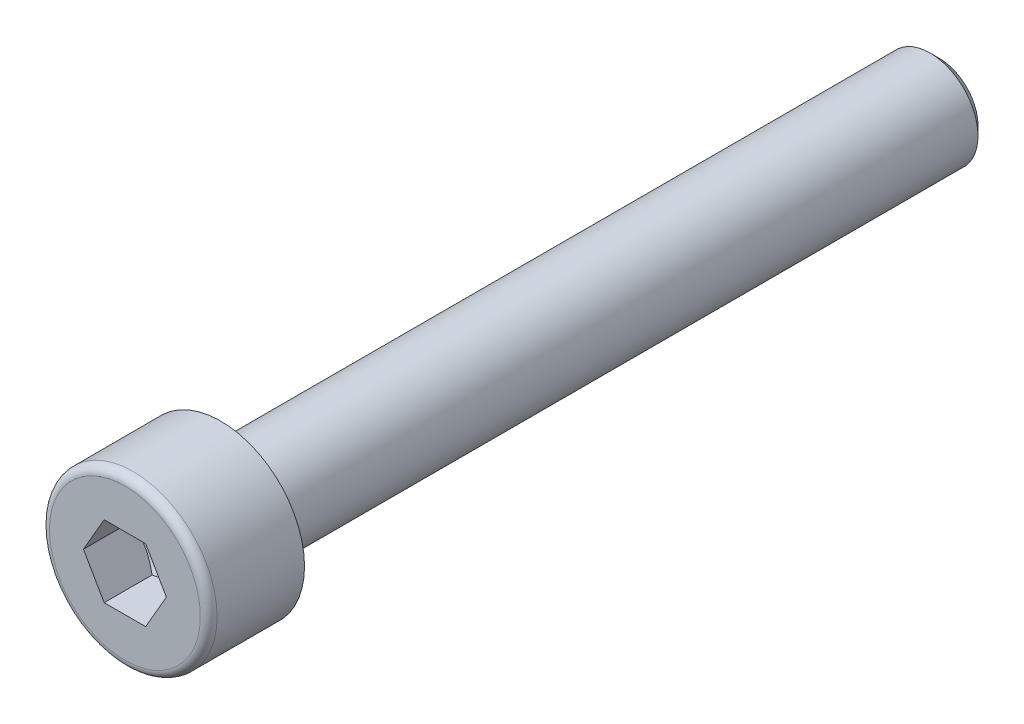
ISO-10303-21;
HEADER;
FILE_DESCRIPTION(('STEP AP214'),'2;1');
FILE_NAME('part.step','',(''),(''),'','','');
FILE_SCHEMA(('AUTOMOTIVE_DESIGN { 1 0 10303 214 1 1 1 1 }'));
ENDSEC;
DATA;
#1=APPLICATION_CONTEXT('core data for automotive mechanical design processes');
#2=APPLICATION_PROTOCOL_DEFINITION('international standard','automotive_design',2000,#1);
#3=PRODUCT_CONTEXT('',#1,'mechanical');
#4=PRODUCT('Part','Part','',(#3));
#5=PRODUCT_RELATED_PRODUCT_CATEGORY('part','',(#4));
#6=PRODUCT_DEFINITION_FORMATION('','',#4);
#7=PRODUCT_DEFINITION_CONTEXT('part definition',#1,'design');
#8=PRODUCT_DEFINITION('design','',#6,#7);
#9=PRODUCT_DEFINITION_SHAPE('','',#8);
#10=(LENGTH_UNIT() NAMED_UNIT(*) SI_UNIT(.MILLI.,.METRE.));
#11=(NAMED_UNIT(*) PLANE_ANGLE_UNIT() SI_UNIT($,.RADIAN.));
#12=(NAMED_UNIT(*) SI_UNIT($,.STERADIAN.) SOLID_ANGLE_UNIT());
#13=UNCERTAINTY_MEASURE_WITH_UNIT(LENGTH_MEASURE(1.E-05),#10,'distance_accuracy_value','');
#14=(GEOMETRIC_REPRESENTATION_CONTEXT(3) GLOBAL_UNCERTAINTY_ASSIGNED_CONTEXT((#13)) GLOBAL_UNIT_ASSIGNED_CONTEXT((#10,
#11,#12)) REPRESENTATION_CONTEXT('',''));
#15=CARTESIAN_POINT('',(0.,0.,0.));
#16=DIRECTION('',(0.,0.,1.));
#17=DIRECTION('',(1.,0.,0.));
#18=AXIS2_PLACEMENT_3D('',#15,#16,#17);
#19=CARTESIAN_POINT('',(0.,3.15,4.));
#20=DIRECTION('',(0.,0.,-1.));
#21=DIRECTION('',(-1.,0.,0.));
#22=AXIS2_PLACEMENT_3D('',#19,#20,#21);
#23=PLANE('',#22);
#24=CARTESIAN_POINT('',(0.,0.,4.));
#25=DIRECTION('',(0.,0.,-1.));
#26=DIRECTION('',(-1.,0.,0.));
#27=AXIS2_PLACEMENT_3D('',#24,#25,#26);
#28=CIRCLE('',#27,3.15);
#29=CARTESIAN_POINT('',(-3.15,0.,4.));
#30=VERTEX_POINT('',#29);
#31=EDGE_CURVE('E54',#30,#30,#28,.F.);
#32=ORIENTED_EDGE('',*,*,#31,.T.);
#33=EDGE_LOOP('',(#32));
#34=FACE_BOUND('',#33,.T.);
#35=DIRECTION('',(0.5,-0.866025403784438,0.));
#36=VECTOR('',#35,1.);
#37=CARTESIAN_POINT('',(0.866025,1.49999930062484,4.));
#38=LINE('',#37,#36);
#39=CARTESIAN_POINT('',(0.866025,1.49999930062484,4.));
#40=VERTEX_POINT('',#39);
#41=CARTESIAN_POINT('',(1.73205,0.,4.));
#42=VERTEX_POINT('',#41);
#43=EDGE_CURVE('E61',#40,#42,#38,.T.);
#44=ORIENTED_EDGE('',*,*,#43,.T.);
#45=DIRECTION('',(-0.5,-0.866025403784439,0.));
#46=VECTOR('',#45,1.);
#47=CARTESIAN_POINT('',(1.73205,0.,4.));
#48=LINE('',#47,#46);
#49=CARTESIAN_POINT('',(0.866025,-1.49999930062484,4.));
#50=VERTEX_POINT('',#49);
#51=EDGE_CURVE('E191',#42,#50,#48,.T.);
#52=ORIENTED_EDGE('',*,*,#51,.T.);
#53=DIRECTION('',(-1.,0.,0.));
#54=VECTOR('',#53,1.);
#55=CARTESIAN_POINT('',(0.866025,-1.49999930062484,4.));
#56=LINE('',#55,#54);
#57=CARTESIAN_POINT('',(-0.866025,-1.49999930062484,4.));
#58=VERTEX_POINT('',#57);
#59=EDGE_CURVE('E463',#50,#58,#56,.T.);
#60=ORIENTED_EDGE('',*,*,#59,.T.);
#61=DIRECTION('',(-0.5,0.866025403784439,0.));
#62=VECTOR('',#61,1.);
#63=CARTESIAN_POINT('',(-0.866025,-1.49999930062484,4.));
#64=LINE('',#63,#62);
#65=CARTESIAN_POINT('',(-1.73205,0.,4.));
#66=VERTEX_POINT('',#65);
#67=EDGE_CURVE('E469',#58,#66,#64,.T.);
#68=ORIENTED_EDGE('',*,*,#67,.T.);
#69=DIRECTION('',(0.5,0.866025403784439,0.));
#70=VECTOR('',#69,1.);
#71=CARTESIAN_POINT('',(-1.73205,0.,4.));
#72=LINE('',#71,#70);
#73=CARTESIAN_POINT('',(-0.866025,1.49999930062484,4.));
#74=VERTEX_POINT('',#73);
#75=EDGE_CURVE('E132',#66,#74,#72,.T.);
#76=ORIENTED_EDGE('',*,*,#75,.T.);
#77=DIRECTION('',(1.,0.,0.));
#78=VECTOR('',#77,1.);
#79=CARTESIAN_POINT('',(-0.866025,1.49999930062484,4.));
#80=LINE('',#79,#78);
#81=EDGE_CURVE('E124',#74,#40,#80,.T.);
#82=ORIENTED_EDGE('',*,*,#81,.T.);
#83=EDGE_LOOP('',(#44,#52,#60,#68,#76,#82));
#84=FACE_BOUND('',#83,.T.);
#85=ADVANCED_FACE('F46',(#34,#84),#23,.F.);
#86=CARTESIAN_POINT('',(0.,0.,0.));
#87=DIRECTION('',(0.,0.,1.));
#88=DIRECTION('',(1.,0.,0.));
#89=AXIS2_PLACEMENT_3D('',#86,#87,#88);
#90=PLANE('',#89);
#91=CARTESIAN_POINT('',(0.,0.,0.));
#92=DIRECTION('',(0.,0.,1.));
#93=DIRECTION('',(1.,0.,0.));
#94=AXIS2_PLACEMENT_3D('',#91,#92,#93);
#95=CIRCLE('',#94,3.5);
#96=CARTESIAN_POINT('',(3.5,0.,0.));
#97=VERTEX_POINT('',#96);
#98=EDGE_CURVE('E148',#97,#97,#95,.T.);
#99=ORIENTED_EDGE('',*,*,#98,.F.);
#100=EDGE_LOOP('',(#99));
#101=FACE_BOUND('',#100,.T.);
#102=CARTESIAN_POINT('',(0.,0.,0.));
#103=DIRECTION('',(0.,0.,1.));
#104=DIRECTION('',(1.,0.,0.));
#105=AXIS2_PLACEMENT_3D('',#102,#103,#104);
#106=CIRCLE('',#105,2.);
#107=CARTESIAN_POINT('',(2.,0.,0.));
#108=VERTEX_POINT('',#107);
#109=EDGE_CURVE('E153',#108,#108,#106,.F.);
#110=ORIENTED_EDGE('',*,*,#109,.F.);
#111=EDGE_LOOP('',(#110));
#112=FACE_BOUND('',#111,.T.);
#113=ADVANCED_FACE('F242',(#101,#112),#90,.F.);
#114=CARTESIAN_POINT('',(0.,0.,4.));
#115=DIRECTION('',(0.,0.,1.));
#116=DIRECTION('',(1.,0.,0.));
#117=AXIS2_PLACEMENT_3D('',#114,#115,#116);
#118=CYLINDRICAL_SURFACE('',#117,3.5);
#119=CARTESIAN_POINT('',(0.,0.,3.65));
#120=DIRECTION('',(0.,0.,-1.));
#121=DIRECTION('',(-1.,0.,0.));
#122=AXIS2_PLACEMENT_3D('',#119,#120,#121);
#123=CIRCLE('',#122,3.5);
#124=CARTESIAN_POINT('',(-3.5,0.,3.65));
#125=VERTEX_POINT('',#124);
#126=EDGE_CURVE('E12',#125,#125,#123,.T.);
#127=ORIENTED_EDGE('',*,*,#126,.T.);
#128=EDGE_LOOP('',(#127));
#129=FACE_BOUND('',#128,.T.);
#130=ORIENTED_EDGE('',*,*,#98,.T.);
#131=EDGE_LOOP('',(#130));
#132=FACE_BOUND('',#131,.T.);
#133=ADVANCED_FACE('F248',(#129,#132),#118,.T.);
#134=CARTESIAN_POINT('',(0.,0.,0.));
#135=DIRECTION('',(0.,0.,1.));
#136=DIRECTION('',(1.,0.,0.));
#137=AXIS2_PLACEMENT_3D('',#134,#135,#136);
#138=CYLINDRICAL_SURFACE('',#137,2.);
#139=ORIENTED_EDGE('',*,*,#109,.T.);
#140=EDGE_LOOP('',(#139));
#141=FACE_BOUND('',#140,.T.);
#142=CARTESIAN_POINT('',(0.,0.,-29.621125));
#143=DIRECTION('',(0.,0.,-1.));
#144=DIRECTION('',(-1.,0.,0.));
#145=AXIS2_PLACEMENT_3D('',#142,#143,#144);
#146=CIRCLE('',#145,2.);
#147=CARTESIAN_POINT('',(-2.,0.,-29.621125));
#148=VERTEX_POINT('',#147);
#149=EDGE_CURVE('E267',#148,#148,#146,.F.);
#150=ORIENTED_EDGE('',*,*,#149,.T.);
#151=EDGE_LOOP('',(#150));
#152=FACE_BOUND('',#151,.T.);
#153=ADVANCED_FACE('F240',(#141,#152),#138,.T.);
#154=CARTESIAN_POINT('',(0.866025,1.49999930062484,1.00000046625011));
#155=DIRECTION('',(-0.866025403784438,-0.5,0.));
#156=DIRECTION('',(-0.5,0.866025403784438,0.));
#157=AXIS2_PLACEMENT_3D('',#154,#155,#156);
#158=PLANE('',#157);
#159=DIRECTION('',(0.,0.,1.));
#160=VECTOR('',#159,1.);
#161=CARTESIAN_POINT('',(1.73205,0.,1.00000046625011));
#162=LINE('',#161,#160);
#163=CARTESIAN_POINT('',(1.73205,0.,2.));
#164=VERTEX_POINT('',#163);
#165=EDGE_CURVE('E145',#164,#42,#162,.T.);
#166=ORIENTED_EDGE('',*,*,#165,.T.);
#167=ORIENTED_EDGE('',*,*,#43,.F.);
#168=DIRECTION('',(0.,0.,1.));
#169=VECTOR('',#168,1.);
#170=CARTESIAN_POINT('',(0.866025,1.49999930062484,1.00000046625011));
#171=LINE('',#170,#169);
#172=CARTESIAN_POINT('',(0.866025,1.49999930062484,2.));
#173=VERTEX_POINT('',#172);
#174=EDGE_CURVE('E117',#173,#40,#171,.T.);
#175=ORIENTED_EDGE('',*,*,#174,.F.);
#176=CARTESIAN_POINT('',(1.73205115470054,-2.E-06,2.00000066666734));
#177=CARTESIAN_POINT('',(1.69399458130122,0.0659139186895892,1.97802228100261));
#178=CARTESIAN_POINT('',(1.65560950414464,0.132398822577242,1.95803408114054));
#179=CARTESIAN_POINT('',(1.57817473630843,0.266519774741864,1.92314525941874));
#180=CARTESIAN_POINT('',(1.53912367019894,0.334158205333232,1.90825697858766));
#181=CARTESIAN_POINT('',(1.46150547885139,0.468596856338784,1.88508226983918));
#182=CARTESIAN_POINT('',(1.42295029290091,0.535376397300293,1.87664158385231));
#183=CARTESIAN_POINT('',(1.34565859846878,0.669249539059823,1.86656700525616));
#184=CARTESIAN_POINT('',(1.30692237073331,0.736342653591208,1.86492476807133));
#185=CARTESIAN_POINT('',(1.23454773253413,0.861699204131607,1.86834969801067));
#186=CARTESIAN_POINT('',(1.20089846229767,0.919981449818777,1.87257593125167));
#187=CARTESIAN_POINT('',(1.1338191361032,1.03616625092508,1.88596796669928));
#188=CARTESIAN_POINT('',(1.10038931198579,1.09406840478452,1.89513833923059));
#189=CARTESIAN_POINT('',(1.03317179328088,1.21049256234014,1.91806252128818));
#190=CARTESIAN_POINT('',(0.999392601793287,1.26899983823525,1.93191346069662));
#191=CARTESIAN_POINT('',(0.932337893068965,1.38514200063251,1.96334924731355));
#192=CARTESIAN_POINT('',(0.89906151743008,1.4427783739308,1.980926712986));
#193=CARTESIAN_POINT('',(0.866023845299461,1.50000130062484,2.00000066666734));
#194=B_SPLINE_CURVE_WITH_KNOTS('',3,(#176,#177,#178,#179,#180,#181,#182,#183,#184,#185,#186,
#187,#188,#189,#190,#191,#192,#193),.UNSPECIFIED.,.F.,.F.,(4,2,2,2,2,2,2,2,4),(0.,
0.237762055931485,0.476095461361748,0.708530837844131,0.94068083294838,1.14278193102308,
1.34507017093339,1.55184422617205,1.75821246569164),.UNSPECIFIED.);
#195=EDGE_CURVE('E109',#164,#173,#194,.T.);
#196=ORIENTED_EDGE('',*,*,#195,.F.);
#197=EDGE_LOOP('',(#166,#167,#175,#196));
#198=FACE_BOUND('',#197,.T.);
#199=ADVANCED_FACE('F118',(#198),#158,.T.);
#200=CARTESIAN_POINT('',(1.73205,0.,1.00000046625011));
#201=DIRECTION('',(-0.866025403784439,0.5,0.));
#202=DIRECTION('',(0.5,0.866025403784439,0.));
#203=AXIS2_PLACEMENT_3D('',#200,#201,#202);
#204=PLANE('',#203);
#205=DIRECTION('',(0.,0.,1.));
#206=VECTOR('',#205,1.);
#207=CARTESIAN_POINT('',(0.866025,-1.49999930062484,1.00000046625011));
#208=LINE('',#207,#206);
#209=CARTESIAN_POINT('',(0.866025,-1.49999930062484,2.));
#210=VERTEX_POINT('',#209);
#211=EDGE_CURVE('E142',#210,#50,#208,.T.);
#212=ORIENTED_EDGE('',*,*,#211,.T.);
#213=ORIENTED_EDGE('',*,*,#51,.F.);
#214=ORIENTED_EDGE('',*,*,#165,.F.);
#215=CARTESIAN_POINT('',(0.866023845299462,-1.50000130062484,2.00000066666734));
#216=CARTESIAN_POINT('',(0.904080418698778,-1.43408538193525,1.9780222810026));
#217=CARTESIAN_POINT('',(0.942465495855361,-1.36760047804759,1.95803408114054));
#218=CARTESIAN_POINT('',(1.01990026369157,-1.23347952588297,1.92314525941874));
#219=CARTESIAN_POINT('',(1.05895132980106,-1.1658410952916,1.90825697858766));
#220=CARTESIAN_POINT('',(1.13656952114861,-1.03140244428605,1.88508226983918));
#221=CARTESIAN_POINT('',(1.1751247070991,-0.964622903324544,1.87664158385231));
#222=CARTESIAN_POINT('',(1.25241640153122,-0.830749761565014,1.86656700525616));
#223=CARTESIAN_POINT('',(1.29115262926669,-0.763656647033629,1.86492476807133));
#224=CARTESIAN_POINT('',(1.36352726746587,-0.638300096493229,1.86834969801067));
#225=CARTESIAN_POINT('',(1.39717653770233,-0.58001785080606,1.87257593125166));
#226=CARTESIAN_POINT('',(1.4642558638968,-0.463833049699756,1.88596796669928));
#227=CARTESIAN_POINT('',(1.49768568801421,-0.405930895840313,1.89513833923059));
#228=CARTESIAN_POINT('',(1.56490320671912,-0.2895067382847,1.91806252128818));
#229=CARTESIAN_POINT('',(1.59868239820671,-0.230999462389588,1.93191346069662));
#230=CARTESIAN_POINT('',(1.66573710693103,-0.11485729999233,1.96334924731355));
#231=CARTESIAN_POINT('',(1.69901348256992,-0.0572209266940348,1.980926712986));
#232=CARTESIAN_POINT('',(1.73205115470054,1.99999999979098E-06,2.00000066666734));
#233=B_SPLINE_CURVE_WITH_KNOTS('',3,(#215,#216,#217,#218,#219,#220,#221,#222,#223,#224,#225,
#226,#227,#228,#229,#230,#231,#232),.UNSPECIFIED.,.F.,.F.,(4,2,2,2,2,2,2,2,4),(0.,
0.237762055931484,0.476095461361747,0.708530837844129,0.940680832948377,1.14278193102307,
1.34507017093338,1.55184422617205,1.75821246569164),.UNSPECIFIED.);
#234=EDGE_CURVE('E113',#210,#164,#233,.T.);
#235=ORIENTED_EDGE('',*,*,#234,.F.);
#236=EDGE_LOOP('',(#212,#213,#214,#235));
#237=FACE_BOUND('',#236,.T.);
#238=ADVANCED_FACE('F231',(#237),#204,.T.);
#239=CARTESIAN_POINT('',(0.866025,-1.49999930062484,1.00000046625011));
#240=DIRECTION('',(0.,1.,0.));
#241=DIRECTION('',(1.,0.,0.));
#242=AXIS2_PLACEMENT_3D('',#239,#240,#241);
#243=PLANE('',#242);
#244=DIRECTION('',(0.,0.,1.));
#245=VECTOR('',#244,1.);
#246=CARTESIAN_POINT('',(-0.866025,-1.49999930062484,1.00000046625011));
#247=LINE('',#246,#245);
#248=CARTESIAN_POINT('',(-0.866025,-1.49999930062484,2.));
#249=VERTEX_POINT('',#248);
#250=EDGE_CURVE('E139',#249,#58,#247,.T.);
#251=ORIENTED_EDGE('',*,*,#250,.T.);
#252=ORIENTED_EDGE('',*,*,#59,.F.);
#253=ORIENTED_EDGE('',*,*,#211,.F.);
#254=CARTESIAN_POINT('',(-2.24271663728987,-1.49999930062484,2.55775267344395));
#255=CARTESIAN_POINT('',(-2.17794141332338,-1.49999930062484,2.52667596135368));
#256=CARTESIAN_POINT('',(-2.11300852130655,-1.49999930062484,2.49592211621229));
#257=CARTESIAN_POINT('',(-1.98274303131292,-1.49999930062484,2.43524311162405));
#258=CARTESIAN_POINT('',(-1.91741036395219,-1.49999930062484,2.40531810131238));
#259=CARTESIAN_POINT('',(-1.78588635397686,-1.49999930062484,2.34631254095844));
#260=CARTESIAN_POINT('',(-1.71969220663993,-1.49999930062484,2.31723821458641));
#261=CARTESIAN_POINT('',(-1.58674953026847,-1.49999930062484,2.26039396688304));
#262=CARTESIAN_POINT('',(-1.52000103027226,-1.49999930062484,2.23262397772829));
#263=CARTESIAN_POINT('',(-1.38408036083489,-1.49999930062484,2.17802545642731));
#264=CARTESIAN_POINT('',(-1.31489044686774,-1.49999930062484,2.1512405113674));
#265=CARTESIAN_POINT('',(-1.17568875836751,-1.49999930062484,2.09990652822181));
#266=CARTESIAN_POINT('',(-1.10567688208708,-1.49999930062484,2.07535777031023));
#267=CARTESIAN_POINT('',(-0.894522216300188,-1.49999930062484,2.0061010834001));
#268=CARTESIAN_POINT('',(-0.751873977094198,-1.49999930062484,1.9656202744164));
#269=CARTESIAN_POINT('',(-0.535047450977606,-1.49999930062484,1.9186645261203));
#270=CARTESIAN_POINT('',(-0.462365424606466,-1.49999930062484,1.90531291688069));
#271=CARTESIAN_POINT('',(-0.316183762847225,-1.49999930062484,1.8841134767258));
#272=CARTESIAN_POINT('',(-0.242684183051902,-1.49999930062484,1.87626527388084));
#273=CARTESIAN_POINT('',(-0.0961588910059515,-1.49999930062484,1.86679859934064));
#274=CARTESIAN_POINT('',(-0.0231380525234333,-1.49999930062484,1.86510661239957));
#275=CARTESIAN_POINT('',(0.122783022434076,-1.49999930062484,1.86789948707645));
#276=CARTESIAN_POINT('',(0.195683251161583,-1.49999930062484,1.8723847311637));
#277=CARTESIAN_POINT('',(0.375553746438775,-1.49999930062484,1.89067768491976));
#278=CARTESIAN_POINT('',(0.4821754471692,-1.49999930062484,1.90791354190592));
#279=CARTESIAN_POINT('',(0.693345462539466,-1.49999930062484,1.95235984396466));
#280=CARTESIAN_POINT('',(0.79789111749796,-1.49999930062484,1.97958231080908));
#281=CARTESIAN_POINT('',(0.954250638010105,-1.49999930062484,2.02608493590371));
#282=CARTESIAN_POINT('',(1.00687274480645,-1.49999930062484,2.04274751774646));
#283=CARTESIAN_POINT('',(1.11156919647057,-1.49999930062484,2.07761406562061));
#284=CARTESIAN_POINT('',(1.16364386068557,-1.49999930062484,2.09581706970924));
#285=CARTESIAN_POINT('',(1.26731501755411,-1.49999930062484,2.13350010092581));
#286=CARTESIAN_POINT('',(1.31891159517315,-1.49999930062484,2.15297989597396));
#287=CARTESIAN_POINT('',(1.42169818698628,-1.49999930062484,2.19300580386973));
#288=CARTESIAN_POINT('',(1.47288813079445,-1.49999930062484,2.21355209687612));
#289=CARTESIAN_POINT('',(1.6035520536722,-1.49999930062484,2.26731329701247));
#290=CARTESIAN_POINT('',(1.68276476914258,-1.49999930062484,2.30116251352867));
#291=CARTESIAN_POINT('',(1.84047488481565,-1.49999930062484,2.37049266735));
#292=CARTESIAN_POINT('',(1.9189722309026,-1.49999930062484,2.40597372689195));
#293=CARTESIAN_POINT('',(2.15362957255391,-1.49999930062484,2.51428942992019));
#294=CARTESIAN_POINT('',(2.3089286607519,-1.49999930062484,2.58898549353906));
#295=CARTESIAN_POINT('',(2.61820006623532,-1.49999930062484,2.74151036059574));
#296=CARTESIAN_POINT('',(2.77217051778771,-1.49999930062484,2.81934290231597));
#297=CARTESIAN_POINT('',(3.07905650209162,-1.49999930062484,2.97700931547993));
#298=CARTESIAN_POINT('',(3.23197216581148,-1.49999930062484,3.05684293253984));
#299=CARTESIAN_POINT('',(3.52267476728495,-1.49999930062484,3.21028853935711));
#300=CARTESIAN_POINT('',(3.66052737206612,-1.49999930062484,3.28377655462836));
#301=CARTESIAN_POINT('',(3.93578914881928,-1.49999930062484,3.43158990958268));
#302=CARTESIAN_POINT('',(4.07319830413762,-1.49999930062484,3.50591528025237));
#303=CARTESIAN_POINT('',(4.34732590427536,-1.49999930062483,3.65500351537988));
#304=CARTESIAN_POINT('',(4.48404521696312,-1.49999930062483,3.72976478622522));
#305=CARTESIAN_POINT('',(4.75720742747683,-1.49999930062483,3.87977391809883));
#306=CARTESIAN_POINT('',(4.89365033939364,-1.49999930062484,3.9550217534582));
#307=CARTESIAN_POINT('',(5.02999394665514,-1.49999930062484,4.03044801324502));
#308=B_SPLINE_CURVE_WITH_KNOTS('',3,(#254,#255,#256,#257,#258,#259,#260,#261,#262,#263,#264,
#265,#266,#267,#268,#269,#270,#271,#272,#273,#274,#275,#276,#277,#278,#279,#280,#281,#282,#283,
#284,#285,#286,#287,#288,#289,#290,#291,#292,#293,#294,#295,#296,#297,#298,#299,#300,#301,#302,
#303,#304,#305,#306,#307),.UNSPECIFIED.,.F.,.F.,(4,2,2,2,2,2,2,2,2,2,2,2,2,2,2,2,2,2,2,2,2,2,2,
2,2,2,4),(0.,0.215535408976475,0.431109351318747,0.647990972858705,0.864861304394723,
1.08740082372431,1.30996818700982,1.75384735851117,1.97537373294937,2.19688513480997,
2.41574248382684,2.63461338422016,2.95796620171825,3.28170955197757,3.44728283297626,
3.61275347131505,3.77819411534645,3.94366279806486,4.20206179692704,4.46048018336434,
4.97740230798824,5.49495989978084,6.01245202818902,6.48110050133562,6.94976637432356,
7.41724019162004,7.88468954517039),.UNSPECIFIED.);
#309=EDGE_CURVE('E221',#249,#210,#308,.T.);
#310=ORIENTED_EDGE('',*,*,#309,.F.);
#311=EDGE_LOOP('',(#251,#252,#253,#310));
#312=FACE_BOUND('',#311,.T.);
#313=ADVANCED_FACE('F227',(#312),#243,.T.);
#314=CARTESIAN_POINT('',(-0.866025,-1.49999930062484,1.00000046625011));
#315=DIRECTION('',(0.866025403784439,0.5,0.));
#316=DIRECTION('',(0.5,-0.866025403784439,0.));
#317=AXIS2_PLACEMENT_3D('',#314,#315,#316);
#318=PLANE('',#317);
#319=DIRECTION('',(0.,0.,1.));
#320=VECTOR('',#319,1.);
#321=CARTESIAN_POINT('',(-1.73205,0.,1.00000046625011));
#322=LINE('',#321,#320);
#323=CARTESIAN_POINT('',(-1.73205,0.,2.));
#324=VERTEX_POINT('',#323);
#325=EDGE_CURVE('E130',#324,#66,#322,.T.);
#326=ORIENTED_EDGE('',*,*,#325,.T.);
#327=ORIENTED_EDGE('',*,*,#67,.F.);
#328=ORIENTED_EDGE('',*,*,#250,.F.);
#329=CARTESIAN_POINT('',(-1.73205115470054,1.99999999935948E-06,2.00000066666734));
#330=CARTESIAN_POINT('',(-1.69399458130122,-0.0659139186895897,1.97802228100261));
#331=CARTESIAN_POINT('',(-1.65560950414464,-0.132398822577242,1.95803408114054));
#332=CARTESIAN_POINT('',(-1.57817473630843,-0.266519774741865,1.92314525941874));
#333=CARTESIAN_POINT('',(-1.53912367019894,-0.334158205333233,1.90825697858766));
#334=CARTESIAN_POINT('',(-1.46150547885139,-0.468596856338785,1.88508226983918));
#335=CARTESIAN_POINT('',(-1.4229502929009,-0.535376397300293,1.87664158385231));
#336=CARTESIAN_POINT('',(-1.34565859846878,-0.669249539059823,1.86656700525616));
#337=CARTESIAN_POINT('',(-1.30692237073331,-0.736342653591209,1.86492476807133));
#338=CARTESIAN_POINT('',(-1.23454773253413,-0.861699204131608,1.86834969801067));
#339=CARTESIAN_POINT('',(-1.20089846229767,-0.919981449818777,1.87257593125166));
#340=CARTESIAN_POINT('',(-1.1338191361032,-1.03616625092508,1.88596796669928));
#341=CARTESIAN_POINT('',(-1.10038931198579,-1.09406840478452,1.89513833923059));
#342=CARTESIAN_POINT('',(-1.03317179328088,-1.21049256234014,1.91806252128818));
#343=CARTESIAN_POINT('',(-0.999392601793289,-1.26899983823525,1.93191346069662));
#344=CARTESIAN_POINT('',(-0.932337893068967,-1.38514200063251,1.96334924731355));
#345=CARTESIAN_POINT('',(-0.899061517430081,-1.4427783739308,1.980926712986));
#346=CARTESIAN_POINT('',(-0.866023845299461,-1.50000130062484,2.00000066666734));
#347=B_SPLINE_CURVE_WITH_KNOTS('',3,(#329,#330,#331,#332,#333,#334,#335,#336,#337,#338,#339,
#340,#341,#342,#343,#344,#345,#346),.UNSPECIFIED.,.F.,.F.,(4,2,2,2,2,2,2,2,4),(0.,
0.237762055931485,0.476095461361749,0.708530837844132,0.94068083294838,1.14278193102308,
1.34507017093338,1.55184422617205,1.75821246569164),.UNSPECIFIED.);
#348=EDGE_CURVE('E216',#324,#249,#347,.T.);
#349=ORIENTED_EDGE('',*,*,#348,.F.);
#350=EDGE_LOOP('',(#326,#327,#328,#349));
#351=FACE_BOUND('',#350,.T.);
#352=ADVANCED_FACE('F230',(#351),#318,.T.);
#353=CARTESIAN_POINT('',(-1.73205,0.,1.00000046625011));
#354=DIRECTION('',(0.866025403784439,-0.5,0.));
#355=DIRECTION('',(-0.5,-0.866025403784439,0.));
#356=AXIS2_PLACEMENT_3D('',#353,#354,#355);
#357=PLANE('',#356);
#358=DIRECTION('',(0.,0.,1.));
#359=VECTOR('',#358,1.);
#360=CARTESIAN_POINT('',(-0.866025,1.49999930062484,1.00000046625011));
#361=LINE('',#360,#359);
#362=CARTESIAN_POINT('',(-0.866025,1.49999930062484,2.));
#363=VERTEX_POINT('',#362);
#364=EDGE_CURVE('E123',#363,#74,#361,.T.);
#365=ORIENTED_EDGE('',*,*,#364,.T.);
#366=ORIENTED_EDGE('',*,*,#75,.F.);
#367=ORIENTED_EDGE('',*,*,#325,.F.);
#368=CARTESIAN_POINT('',(-0.866023845299462,1.50000130062484,2.00000066666734));
#369=CARTESIAN_POINT('',(-0.904080418698778,1.43408538193525,1.9780222810026));
#370=CARTESIAN_POINT('',(-0.942465495855361,1.36760047804759,1.95803408114054));
#371=CARTESIAN_POINT('',(-1.01990026369157,1.23347952588297,1.92314525941874));
#372=CARTESIAN_POINT('',(-1.05895132980106,1.1658410952916,1.90825697858766));
#373=CARTESIAN_POINT('',(-1.13656952114861,1.03140244428605,1.88508226983918));
#374=CARTESIAN_POINT('',(-1.1751247070991,0.964622903324544,1.87664158385231));
#375=CARTESIAN_POINT('',(-1.25241640153122,0.830749761565014,1.86656700525616));
#376=CARTESIAN_POINT('',(-1.29115262926669,0.763656647033629,1.86492476807133));
#377=CARTESIAN_POINT('',(-1.36352726746587,0.638300096493229,1.86834969801067));
#378=CARTESIAN_POINT('',(-1.39717653770233,0.58001785080606,1.87257593125166));
#379=CARTESIAN_POINT('',(-1.4642558638968,0.463833049699756,1.88596796669928));
#380=CARTESIAN_POINT('',(-1.49768568801421,0.405930895840313,1.89513833923059));
#381=CARTESIAN_POINT('',(-1.56490320671912,0.289506738284699,1.91806252128818));
#382=CARTESIAN_POINT('',(-1.59868239820671,0.230999462389588,1.93191346069662));
#383=CARTESIAN_POINT('',(-1.66573710693103,0.11485729999233,1.96334924731355));
#384=CARTESIAN_POINT('',(-1.69901348256992,0.0572209266940344,1.980926712986));
#385=CARTESIAN_POINT('',(-1.73205115470054,-2.00000000048508E-06,2.00000066666734));
#386=B_SPLINE_CURVE_WITH_KNOTS('',3,(#368,#369,#370,#371,#372,#373,#374,#375,#376,#377,#378,
#379,#380,#381,#382,#383,#384,#385),.UNSPECIFIED.,.F.,.F.,(4,2,2,2,2,2,2,2,4),(0.,
0.237762055931484,0.476095461361747,0.708530837844129,0.940680832948377,1.14278193102307,
1.34507017093338,1.55184422617205,1.75821246569164),.UNSPECIFIED.);
#387=EDGE_CURVE('E69',#363,#324,#386,.T.);
#388=ORIENTED_EDGE('',*,*,#387,.F.);
#389=EDGE_LOOP('',(#365,#366,#367,#388));
#390=FACE_BOUND('',#389,.T.);
#391=ADVANCED_FACE('F317',(#390),#357,.T.);
#392=CARTESIAN_POINT('',(-0.866025,1.49999930062484,1.00000046625011));
#393=DIRECTION('',(0.,-1.,0.));
#394=DIRECTION('',(-1.,0.,0.));
#395=AXIS2_PLACEMENT_3D('',#392,#393,#394);
#396=PLANE('',#395);
#397=ORIENTED_EDGE('',*,*,#174,.T.);
#398=ORIENTED_EDGE('',*,*,#81,.F.);
#399=ORIENTED_EDGE('',*,*,#364,.F.);
#400=CARTESIAN_POINT('',(-2.24271663728987,1.49999930062484,2.55775267344395));
#401=CARTESIAN_POINT('',(-2.17794141332338,1.49999930062484,2.52667596135368));
#402=CARTESIAN_POINT('',(-2.11300852130655,1.49999930062484,2.49592211621229));
#403=CARTESIAN_POINT('',(-1.98274303131292,1.49999930062484,2.43524311162405));
#404=CARTESIAN_POINT('',(-1.91741036395219,1.49999930062484,2.40531810131238));
#405=CARTESIAN_POINT('',(-1.78588635397687,1.49999930062484,2.34631254095844));
#406=CARTESIAN_POINT('',(-1.71969220663993,1.49999930062484,2.31723821458641));
#407=CARTESIAN_POINT('',(-1.58674953026847,1.49999930062484,2.26039396688304));
#408=CARTESIAN_POINT('',(-1.52000103027226,1.49999930062484,2.23262397772829));
#409=CARTESIAN_POINT('',(-1.3840803608349,1.49999930062484,2.17802545642731));
#410=CARTESIAN_POINT('',(-1.31489044686775,1.49999930062484,2.1512405113674));
#411=CARTESIAN_POINT('',(-1.17568875836751,1.49999930062484,2.09990652822181));
#412=CARTESIAN_POINT('',(-1.10567688208708,1.49999930062484,2.07535777031023));
#413=CARTESIAN_POINT('',(-0.894522216300189,1.49999930062484,2.0061010834001));
#414=CARTESIAN_POINT('',(-0.751873977094199,1.49999930062484,1.9656202744164));
#415=CARTESIAN_POINT('',(-0.535047450977607,1.49999930062484,1.9186645261203));
#416=CARTESIAN_POINT('',(-0.462365424606467,1.49999930062484,1.90531291688069));
#417=CARTESIAN_POINT('',(-0.316183762847226,1.49999930062484,1.8841134767258));
#418=CARTESIAN_POINT('',(-0.242684183051903,1.49999930062484,1.87626527388084));
#419=CARTESIAN_POINT('',(-0.0961588910059524,1.49999930062484,1.86679859934064));
#420=CARTESIAN_POINT('',(-0.0231380525234342,1.49999930062484,1.86510661239957));
#421=CARTESIAN_POINT('',(0.122783022434075,1.49999930062484,1.86789948707645));
#422=CARTESIAN_POINT('',(0.195683251161582,1.49999930062484,1.8723847311637));
#423=CARTESIAN_POINT('',(0.375553746438774,1.49999930062484,1.89067768491976));
#424=CARTESIAN_POINT('',(0.482175447169199,1.49999930062484,1.90791354190592));
#425=CARTESIAN_POINT('',(0.693345462539464,1.49999930062484,1.95235984396466));
#426=CARTESIAN_POINT('',(0.797891117497957,1.49999930062484,1.97958231080908));
#427=CARTESIAN_POINT('',(0.954250638010102,1.49999930062484,2.02608493590371));
#428=CARTESIAN_POINT('',(1.00687274480645,1.49999930062484,2.04274751774646));
#429=CARTESIAN_POINT('',(1.11156919647056,1.49999930062484,2.07761406562061));
#430=CARTESIAN_POINT('',(1.16364386068556,1.49999930062484,2.09581706970924));
#431=CARTESIAN_POINT('',(1.2673150175541,1.49999930062484,2.13350010092581));
#432=CARTESIAN_POINT('',(1.31891159517315,1.49999930062484,2.15297989597396));
#433=CARTESIAN_POINT('',(1.42169818698628,1.49999930062484,2.19300580386972));
#434=CARTESIAN_POINT('',(1.47288813079445,1.49999930062484,2.21355209687612));
#435=CARTESIAN_POINT('',(1.60355205367219,1.49999930062484,2.26731329701247));
#436=CARTESIAN_POINT('',(1.68276476914257,1.49999930062484,2.30116251352867));
#437=CARTESIAN_POINT('',(1.84047488481565,1.49999930062484,2.37049266735));
#438=CARTESIAN_POINT('',(1.91897223090259,1.49999930062484,2.40597372689195));
#439=CARTESIAN_POINT('',(2.15362957255391,1.49999930062484,2.51428942992019));
#440=CARTESIAN_POINT('',(2.30892866075189,1.49999930062484,2.58898549353906));
#441=CARTESIAN_POINT('',(2.61820006623532,1.49999930062484,2.74151036059574));
#442=CARTESIAN_POINT('',(2.77217051778771,1.49999930062484,2.81934290231597));
#443=CARTESIAN_POINT('',(3.07905650209162,1.49999930062484,2.97700931547993));
#444=CARTESIAN_POINT('',(3.23197216581148,1.49999930062484,3.05684293253984));
#445=CARTESIAN_POINT('',(3.52267476728495,1.49999930062484,3.21028853935711));
#446=CARTESIAN_POINT('',(3.66052737206611,1.49999930062484,3.28377655462836));
#447=CARTESIAN_POINT('',(3.93578914881928,1.49999930062484,3.43158990958268));
#448=CARTESIAN_POINT('',(4.07319830413762,1.49999930062484,3.50591528025237));
#449=CARTESIAN_POINT('',(4.34732590427536,1.49999930062484,3.65500351537988));
#450=CARTESIAN_POINT('',(4.48404521696312,1.49999930062484,3.72976478622523));
#451=CARTESIAN_POINT('',(4.75720742747683,1.49999930062484,3.87977391809883));
#452=CARTESIAN_POINT('',(4.89365033939364,1.49999930062484,3.9550217534582));
#453=CARTESIAN_POINT('',(5.02999394665514,1.49999930062484,4.03044801324502));
#454=B_SPLINE_CURVE_WITH_KNOTS('',3,(#400,#401,#402,#403,#404,#405,#406,#407,#408,#409,#410,
#411,#412,#413,#414,#415,#416,#417,#418,#419,#420,#421,#422,#423,#424,#425,#426,#427,#428,#429,
#430,#431,#432,#433,#434,#435,#436,#437,#438,#439,#440,#441,#442,#443,#444,#445,#446,#447,#448,
#449,#450,#451,#452,#453),.UNSPECIFIED.,.F.,.F.,(4,2,2,2,2,2,2,2,2,2,2,2,2,2,2,2,2,2,2,2,2,2,2,
2,2,2,4),(0.,0.215535408976474,0.431109351318746,0.647990972858704,0.864861304394721,
1.0874008237243,1.30996818700982,1.75384735851117,1.97537373294937,2.19688513480997,
2.41574248382684,2.63461338422015,2.95796620171825,3.28170955197757,3.44728283297626,
3.61275347131505,3.77819411534645,3.94366279806485,4.20206179692704,4.46048018336433,
4.97740230798824,5.49495989978084,6.01245202818902,6.48110050133561,6.94976637432355,
7.41724019162004,7.88468954517039),.UNSPECIFIED.);
#455=EDGE_CURVE('E110',#173,#363,#454,.F.);
#456=ORIENTED_EDGE('',*,*,#455,.F.);
#457=EDGE_LOOP('',(#397,#398,#399,#456));
#458=FACE_BOUND('',#457,.T.);
#459=ADVANCED_FACE('F105',(#458),#396,.T.);
#460=CARTESIAN_POINT('',(0.,0.,1.00000046625011));
#461=DIRECTION('',(0.,0.,1.));
#462=DIRECTION('',(1.,0.,0.));
#463=AXIS2_PLACEMENT_3D('',#460,#461,#462);
#464=CONICAL_SURFACE('',#463,0.,1.0471975511966);
#465=CARTESIAN_POINT('',(0.,0.,1.00000046625011));
#466=VERTEX_POINT('',#465);
#467=VERTEX_LOOP('',#466);
#468=FACE_BOUND('',#467,.T.);
#469=ORIENTED_EDGE('',*,*,#195,.T.);
#470=ORIENTED_EDGE('',*,*,#455,.T.);
#471=ORIENTED_EDGE('',*,*,#387,.T.);
#472=ORIENTED_EDGE('',*,*,#348,.T.);
#473=ORIENTED_EDGE('',*,*,#309,.T.);
#474=ORIENTED_EDGE('',*,*,#234,.T.);
#475=EDGE_LOOP('',(#469,#470,#471,#472,#473,#474));
#476=FACE_BOUND('',#475,.T.);
#477=ADVANCED_FACE('F102',(#468,#476),#464,.F.);
#478=CARTESIAN_POINT('',(0.,0.,3.65));
#479=DIRECTION('',(0.,0.,-1.));
#480=DIRECTION('',(-1.,0.,0.));
#481=AXIS2_PLACEMENT_3D('',#478,#479,#480);
#482=TOROIDAL_SURFACE('',#481,3.15,0.35);
#483=ORIENTED_EDGE('',*,*,#126,.F.);
#484=EDGE_LOOP('',(#483));
#485=FACE_BOUND('',#484,.T.);
#486=ORIENTED_EDGE('',*,*,#31,.F.);
#487=EDGE_LOOP('',(#486));
#488=FACE_BOUND('',#487,.T.);
#489=ADVANCED_FACE('F48',(#485,#488),#482,.T.);
#490=CARTESIAN_POINT('',(0.,0.,-30.));
#491=DIRECTION('',(0.,0.,-1.));
#492=DIRECTION('',(-1.,0.,0.));
#493=AXIS2_PLACEMENT_3D('',#490,#491,#492);
#494=PLANE('',#493);
#495=CARTESIAN_POINT('',(0.,0.,-30.));
#496=DIRECTION('',(0.,0.,-1.));
#497=DIRECTION('',(-1.,0.,0.));
#498=AXIS2_PLACEMENT_3D('',#495,#496,#497);
#499=CIRCLE('',#498,1.621125);
#500=CARTESIAN_POINT('',(-1.621125,0.,-30.));
#501=VERTEX_POINT('',#500);
#502=EDGE_CURVE('E264',#501,#501,#499,.T.);
#503=ORIENTED_EDGE('',*,*,#502,.T.);
#504=EDGE_LOOP('',(#503));
#505=FACE_BOUND('',#504,.T.);
#506=ADVANCED_FACE('F199',(#505),#494,.T.);
#507=CARTESIAN_POINT('',(0.,0.,-29.621125));
#508=DIRECTION('',(0.,0.,1.));
#509=DIRECTION('',(1.,0.,0.));
#510=AXIS2_PLACEMENT_3D('',#507,#508,#509);
#511=CONICAL_SURFACE('',#510,2.,0.785398163397451);
#512=ORIENTED_EDGE('',*,*,#502,.F.);
#513=EDGE_LOOP('',(#512));
#514=FACE_BOUND('',#513,.T.);
#515=ORIENTED_EDGE('',*,*,#149,.F.);
#516=EDGE_LOOP('',(#515));
#517=FACE_BOUND('',#516,.T.);
#518=ADVANCED_FACE('F254',(#514,#517),#511,.T.);
#519=CLOSED_SHELL('',(#85,#113,#133,#153,#199,#238,#313,#352,#391,#459,#477,#489,#506,#518));
#520=MANIFOLD_SOLID_BREP('B2',#519);
#521=ADVANCED_BREP_SHAPE_REPRESENTATION('',(#18,#520),#14);
#522=SHAPE_DEFINITION_REPRESENTATION(#9,#521);
ENDSEC;
END-ISO-10303-21;
